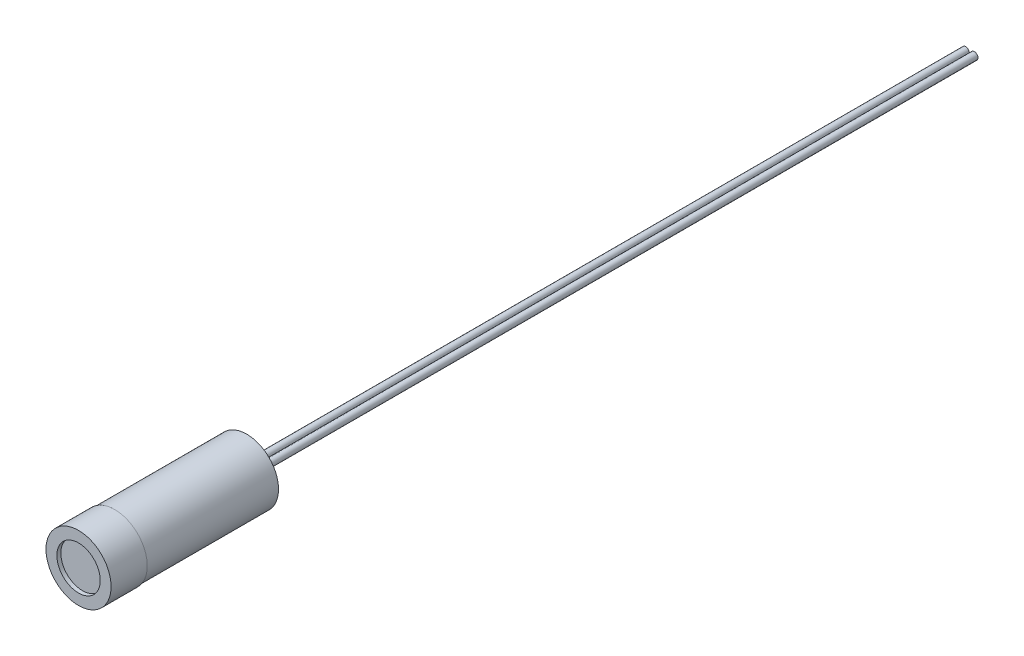
ISO-10303-21;
HEADER;
FILE_DESCRIPTION(('STEP AP214'),'2;1');
FILE_NAME('part.step','',(''),(''),'','','');
FILE_SCHEMA(('AUTOMOTIVE_DESIGN { 1 0 10303 214 1 1 1 1 }'));
ENDSEC;
DATA;
#1=APPLICATION_CONTEXT('core data for automotive mechanical design processes');
#2=APPLICATION_PROTOCOL_DEFINITION('international standard','automotive_design',2000,#1);
#3=PRODUCT_CONTEXT('',#1,'mechanical');
#4=PRODUCT('Part','Part','',(#3));
#5=PRODUCT_RELATED_PRODUCT_CATEGORY('part','',(#4));
#6=PRODUCT_DEFINITION_FORMATION('','',#4);
#7=PRODUCT_DEFINITION_CONTEXT('part definition',#1,'design');
#8=PRODUCT_DEFINITION('design','',#6,#7);
#9=PRODUCT_DEFINITION_SHAPE('','',#8);
#10=(LENGTH_UNIT() NAMED_UNIT(*) SI_UNIT(.MILLI.,.METRE.));
#11=(NAMED_UNIT(*) PLANE_ANGLE_UNIT() SI_UNIT($,.RADIAN.));
#12=(NAMED_UNIT(*) SI_UNIT($,.STERADIAN.) SOLID_ANGLE_UNIT());
#13=UNCERTAINTY_MEASURE_WITH_UNIT(LENGTH_MEASURE(1.E-05),#10,'distance_accuracy_value','');
#14=(GEOMETRIC_REPRESENTATION_CONTEXT(3) GLOBAL_UNCERTAINTY_ASSIGNED_CONTEXT((#13)) GLOBAL_UNIT_ASSIGNED_CONTEXT((#10,
#11,#12)) REPRESENTATION_CONTEXT('',''));
#15=CARTESIAN_POINT('',(0.,0.,0.));
#16=DIRECTION('',(0.,0.,1.));
#17=DIRECTION('',(1.,0.,0.));
#18=AXIS2_PLACEMENT_3D('',#15,#16,#17);
#19=CARTESIAN_POINT('',(0.,0.,-23.25));
#20=DIRECTION('',(0.,0.,-1.));
#21=DIRECTION('',(-1.,0.,0.));
#22=AXIS2_PLACEMENT_3D('',#19,#20,#21);
#23=PLANE('',#22);
#24=CARTESIAN_POINT('',(-0.6,0.,-23.25));
#25=DIRECTION('',(0.,0.,-1.));
#26=DIRECTION('',(-1.,0.,0.));
#27=AXIS2_PLACEMENT_3D('',#24,#25,#26);
#28=CIRCLE('',#27,0.5);
#29=CARTESIAN_POINT('',(-1.1,0.,-23.25));
#30=VERTEX_POINT('',#29);
#31=EDGE_CURVE('E10',#30,#30,#28,.T.);
#32=ORIENTED_EDGE('',*,*,#31,.F.);
#33=EDGE_LOOP('',(#32));
#34=FACE_BOUND('',#33,.T.);
#35=CARTESIAN_POINT('',(0.,0.,-23.25));
#36=DIRECTION('',(0.,0.,-1.));
#37=DIRECTION('',(-1.,0.,0.));
#38=AXIS2_PLACEMENT_3D('',#35,#36,#37);
#39=CIRCLE('',#38,4.4);
#40=CARTESIAN_POINT('',(-4.4,0.,-23.25));
#41=VERTEX_POINT('',#40);
#42=EDGE_CURVE('E50',#41,#41,#39,.T.);
#43=ORIENTED_EDGE('',*,*,#42,.T.);
#44=EDGE_LOOP('',(#43));
#45=FACE_BOUND('',#44,.T.);
#46=CARTESIAN_POINT('',(0.6,0.,-23.25));
#47=DIRECTION('',(0.,0.,-1.));
#48=DIRECTION('',(-1.,0.,0.));
#49=AXIS2_PLACEMENT_3D('',#46,#47,#48);
#50=CIRCLE('',#49,0.5);
#51=CARTESIAN_POINT('',(0.0999999999999999,0.,-23.25));
#52=VERTEX_POINT('',#51);
#53=EDGE_CURVE('E60',#52,#52,#50,.T.);
#54=ORIENTED_EDGE('',*,*,#53,.F.);
#55=EDGE_LOOP('',(#54));
#56=FACE_BOUND('',#55,.T.);
#57=ADVANCED_FACE('F30',(#34,#45,#56),#23,.T.);
#58=CARTESIAN_POINT('',(0.,0.,0.));
#59=DIRECTION('',(0.,0.,-1.));
#60=DIRECTION('',(-1.,0.,0.));
#61=AXIS2_PLACEMENT_3D('',#58,#59,#60);
#62=CYLINDRICAL_SURFACE('',#61,4.5);
#63=CARTESIAN_POINT('',(0.,0.,0.));
#64=DIRECTION('',(0.,0.,-1.));
#65=DIRECTION('',(-1.,0.,0.));
#66=AXIS2_PLACEMENT_3D('',#63,#64,#65);
#67=CIRCLE('',#66,4.5);
#68=CARTESIAN_POINT('',(-4.5,0.,0.));
#69=VERTEX_POINT('',#68);
#70=EDGE_CURVE('E37',#69,#69,#67,.T.);
#71=ORIENTED_EDGE('',*,*,#70,.T.);
#72=EDGE_LOOP('',(#71));
#73=FACE_BOUND('',#72,.T.);
#74=CARTESIAN_POINT('',(0.,0.,-5.));
#75=DIRECTION('',(0.,0.,-1.));
#76=DIRECTION('',(-1.,0.,0.));
#77=AXIS2_PLACEMENT_3D('',#74,#75,#76);
#78=CIRCLE('',#77,4.5);
#79=CARTESIAN_POINT('',(-4.5,0.,-5.));
#80=VERTEX_POINT('',#79);
#81=EDGE_CURVE('E56',#80,#80,#78,.T.);
#82=ORIENTED_EDGE('',*,*,#81,.F.);
#83=EDGE_LOOP('',(#82));
#84=FACE_BOUND('',#83,.T.);
#85=ADVANCED_FACE('F32',(#73,#84),#62,.T.);
#86=CARTESIAN_POINT('',(0.,4.5,0.));
#87=DIRECTION('',(0.,0.,1.));
#88=DIRECTION('',(1.,0.,0.));
#89=AXIS2_PLACEMENT_3D('',#86,#87,#88);
#90=PLANE('',#89);
#91=CARTESIAN_POINT('',(0.,0.,0.));
#92=DIRECTION('',(0.,0.,-1.));
#93=DIRECTION('',(-1.,0.,0.));
#94=AXIS2_PLACEMENT_3D('',#91,#92,#93);
#95=CIRCLE('',#94,3.);
#96=CARTESIAN_POINT('',(-3.,0.,0.));
#97=VERTEX_POINT('',#96);
#98=EDGE_CURVE('E41',#97,#97,#95,.T.);
#99=ORIENTED_EDGE('',*,*,#98,.T.);
#100=EDGE_LOOP('',(#99));
#101=FACE_BOUND('',#100,.T.);
#102=ORIENTED_EDGE('',*,*,#70,.F.);
#103=EDGE_LOOP('',(#102));
#104=FACE_BOUND('',#103,.T.);
#105=ADVANCED_FACE('F85',(#101,#104),#90,.T.);
#106=CARTESIAN_POINT('',(0.,0.,0.));
#107=DIRECTION('',(0.,0.,-1.));
#108=DIRECTION('',(-1.,0.,0.));
#109=AXIS2_PLACEMENT_3D('',#106,#107,#108);
#110=CYLINDRICAL_SURFACE('',#109,3.);
#111=CARTESIAN_POINT('',(0.,0.,-0.55));
#112=DIRECTION('',(0.,0.,-1.));
#113=DIRECTION('',(-1.,0.,0.));
#114=AXIS2_PLACEMENT_3D('',#111,#112,#113);
#115=CIRCLE('',#114,3.);
#116=CARTESIAN_POINT('',(-3.,0.,-0.55));
#117=VERTEX_POINT('',#116);
#118=EDGE_CURVE('E45',#117,#117,#115,.T.);
#119=ORIENTED_EDGE('',*,*,#118,.T.);
#120=EDGE_LOOP('',(#119));
#121=FACE_BOUND('',#120,.T.);
#122=ORIENTED_EDGE('',*,*,#98,.F.);
#123=EDGE_LOOP('',(#122));
#124=FACE_BOUND('',#123,.T.);
#125=ADVANCED_FACE('F94',(#121,#124),#110,.F.);
#126=CARTESIAN_POINT('',(0.,3.,-0.55));
#127=DIRECTION('',(0.,0.,1.));
#128=DIRECTION('',(1.,0.,0.));
#129=AXIS2_PLACEMENT_3D('',#126,#127,#128);
#130=PLANE('',#129);
#131=ORIENTED_EDGE('',*,*,#118,.F.);
#132=EDGE_LOOP('',(#131));
#133=FACE_BOUND('',#132,.T.);
#134=ADVANCED_FACE('F91',(#133),#130,.T.);
#135=CARTESIAN_POINT('',(0.,0.,0.));
#136=DIRECTION('',(0.,0.,-1.));
#137=DIRECTION('',(-1.,0.,0.));
#138=AXIS2_PLACEMENT_3D('',#135,#136,#137);
#139=CYLINDRICAL_SURFACE('',#138,4.4);
#140=CARTESIAN_POINT('',(0.,0.,-5.));
#141=DIRECTION('',(0.,0.,-1.));
#142=DIRECTION('',(-1.,0.,0.));
#143=AXIS2_PLACEMENT_3D('',#140,#141,#142);
#144=CIRCLE('',#143,4.4);
#145=CARTESIAN_POINT('',(-4.4,0.,-5.));
#146=VERTEX_POINT('',#145);
#147=EDGE_CURVE('E53',#146,#146,#144,.T.);
#148=ORIENTED_EDGE('',*,*,#147,.T.);
#149=EDGE_LOOP('',(#148));
#150=FACE_BOUND('',#149,.T.);
#151=ORIENTED_EDGE('',*,*,#42,.F.);
#152=EDGE_LOOP('',(#151));
#153=FACE_BOUND('',#152,.T.);
#154=ADVANCED_FACE('F89',(#150,#153),#139,.T.);
#155=CARTESIAN_POINT('',(0.,4.4,-5.));
#156=DIRECTION('',(0.,0.,-1.));
#157=DIRECTION('',(-1.,0.,0.));
#158=AXIS2_PLACEMENT_3D('',#155,#156,#157);
#159=PLANE('',#158);
#160=ORIENTED_EDGE('',*,*,#81,.T.);
#161=EDGE_LOOP('',(#160));
#162=FACE_BOUND('',#161,.T.);
#163=ORIENTED_EDGE('',*,*,#147,.F.);
#164=EDGE_LOOP('',(#163));
#165=FACE_BOUND('',#164,.T.);
#166=ADVANCED_FACE('F121',(#162,#165),#159,.T.);
#167=CARTESIAN_POINT('',(0.6,0.,-123.25));
#168=DIRECTION('',(0.,0.,1.));
#169=DIRECTION('',(1.,0.,0.));
#170=AXIS2_PLACEMENT_3D('',#167,#168,#169);
#171=CYLINDRICAL_SURFACE('',#170,0.5);
#172=CARTESIAN_POINT('',(0.6,0.,-123.25));
#173=DIRECTION('',(0.,0.,-1.));
#174=DIRECTION('',(-1.,0.,0.));
#175=AXIS2_PLACEMENT_3D('',#172,#173,#174);
#176=CIRCLE('',#175,0.5);
#177=CARTESIAN_POINT('',(0.0999999999999999,0.,-123.25));
#178=VERTEX_POINT('',#177);
#179=EDGE_CURVE('E59',#178,#178,#176,.T.);
#180=ORIENTED_EDGE('',*,*,#179,.F.);
#181=EDGE_LOOP('',(#180));
#182=FACE_BOUND('',#181,.T.);
#183=ORIENTED_EDGE('',*,*,#53,.T.);
#184=EDGE_LOOP('',(#183));
#185=FACE_BOUND('',#184,.T.);
#186=ADVANCED_FACE('F128',(#182,#185),#171,.T.);
#187=CARTESIAN_POINT('',(0.6,0.,-123.25));
#188=DIRECTION('',(0.,0.,-1.));
#189=DIRECTION('',(-1.,0.,0.));
#190=AXIS2_PLACEMENT_3D('',#187,#188,#189);
#191=PLANE('',#190);
#192=ORIENTED_EDGE('',*,*,#179,.T.);
#193=EDGE_LOOP('',(#192));
#194=FACE_BOUND('',#193,.T.);
#195=ADVANCED_FACE('F77',(#194),#191,.T.);
#196=CARTESIAN_POINT('',(-0.6,0.,-123.25));
#197=DIRECTION('',(0.,0.,1.));
#198=DIRECTION('',(1.,0.,0.));
#199=AXIS2_PLACEMENT_3D('',#196,#197,#198);
#200=CYLINDRICAL_SURFACE('',#199,0.5);
#201=CARTESIAN_POINT('',(-0.6,0.,-123.25));
#202=DIRECTION('',(0.,0.,1.));
#203=DIRECTION('',(1.,0.,0.));
#204=AXIS2_PLACEMENT_3D('',#201,#202,#203);
#205=CIRCLE('',#204,0.5);
#206=CARTESIAN_POINT('',(-0.0999999999999999,0.,-123.25));
#207=VERTEX_POINT('',#206);
#208=EDGE_CURVE('E63',#207,#207,#205,.T.);
#209=ORIENTED_EDGE('',*,*,#208,.T.);
#210=EDGE_LOOP('',(#209));
#211=FACE_BOUND('',#210,.T.);
#212=ORIENTED_EDGE('',*,*,#31,.T.);
#213=EDGE_LOOP('',(#212));
#214=FACE_BOUND('',#213,.T.);
#215=ADVANCED_FACE('F69',(#211,#214),#200,.T.);
#216=CARTESIAN_POINT('',(-0.6,0.,-123.25));
#217=DIRECTION('',(0.,0.,-1.));
#218=DIRECTION('',(1.,0.,0.));
#219=AXIS2_PLACEMENT_3D('',#216,#217,#218);
#220=PLANE('',#219);
#221=ORIENTED_EDGE('',*,*,#208,.F.);
#222=EDGE_LOOP('',(#221));
#223=FACE_BOUND('',#222,.T.);
#224=ADVANCED_FACE('F71',(#223),#220,.T.);
#225=CLOSED_SHELL('',(#57,#85,#105,#125,#134,#154,#166,#186,#195,#215,#224));
#226=MANIFOLD_SOLID_BREP('B2',#225);
#227=ADVANCED_BREP_SHAPE_REPRESENTATION('',(#18,#226),#14);
#228=SHAPE_DEFINITION_REPRESENTATION(#9,#227);
ENDSEC;
END-ISO-10303-21;
